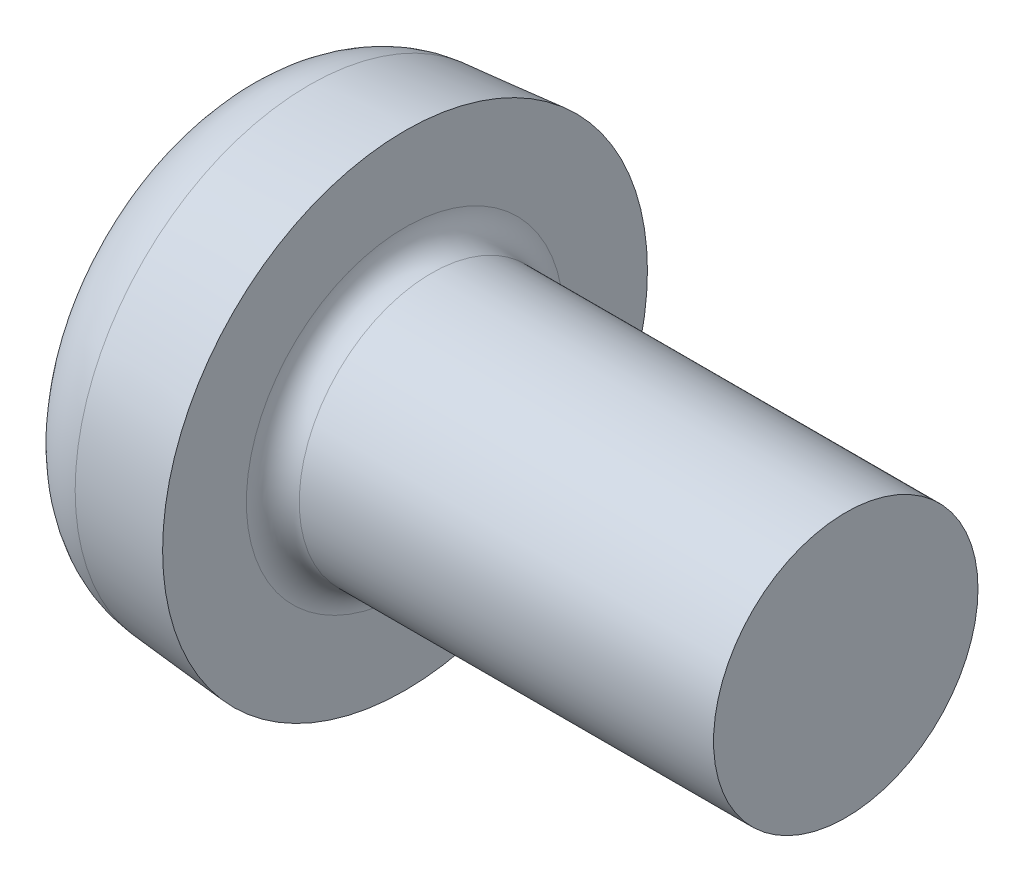
ISO-10303-21;
HEADER;
FILE_DESCRIPTION(('STEP AP214'),'2;1');
FILE_NAME('part.step','',(''),(''),'','','');
FILE_SCHEMA(('AUTOMOTIVE_DESIGN { 1 0 10303 214 1 1 1 1 }'));
ENDSEC;
DATA;
#1=APPLICATION_CONTEXT('core data for automotive mechanical design processes');
#2=APPLICATION_PROTOCOL_DEFINITION('international standard','automotive_design',2000,#1);
#3=PRODUCT_CONTEXT('',#1,'mechanical');
#4=PRODUCT('Part','Part','',(#3));
#5=PRODUCT_RELATED_PRODUCT_CATEGORY('part','',(#4));
#6=PRODUCT_DEFINITION_FORMATION('','',#4);
#7=PRODUCT_DEFINITION_CONTEXT('part definition',#1,'design');
#8=PRODUCT_DEFINITION('design','',#6,#7);
#9=PRODUCT_DEFINITION_SHAPE('','',#8);
#10=(LENGTH_UNIT() NAMED_UNIT(*) SI_UNIT(.MILLI.,.METRE.));
#11=(NAMED_UNIT(*) PLANE_ANGLE_UNIT() SI_UNIT($,.RADIAN.));
#12=(NAMED_UNIT(*) SI_UNIT($,.STERADIAN.) SOLID_ANGLE_UNIT());
#13=UNCERTAINTY_MEASURE_WITH_UNIT(LENGTH_MEASURE(1.E-05),#10,'distance_accuracy_value','');
#14=(GEOMETRIC_REPRESENTATION_CONTEXT(3) GLOBAL_UNCERTAINTY_ASSIGNED_CONTEXT((#13)) GLOBAL_UNIT_ASSIGNED_CONTEXT((#10,
#11,#12)) REPRESENTATION_CONTEXT('',''));
#15=CARTESIAN_POINT('',(0.,0.,0.));
#16=DIRECTION('',(0.,0.,1.));
#17=DIRECTION('',(1.,0.,0.));
#18=AXIS2_PLACEMENT_3D('',#15,#16,#17);
#19=CARTESIAN_POINT('',(0.,0.,0.));
#20=DIRECTION('',(-1.,0.,0.));
#21=DIRECTION('',(0.,0.,1.));
#22=AXIS2_PLACEMENT_3D('',#19,#20,#21);
#23=PLANE('',#22);
#24=DIRECTION('',(0.,1.,0.));
#25=VECTOR('',#24,1.);
#26=CARTESIAN_POINT('',(0.,0.349999999999987,-0.349999999999996));
#27=LINE('',#26,#25);
#28=CARTESIAN_POINT('',(1.66533453693773E-13,0.649999999999984,-0.349999999999996));
#29=VERTEX_POINT('',#28);
#30=CARTESIAN_POINT('',(-1.66533453693773E-13,1.62134434609832,-0.349999999999996));
#31=VERTEX_POINT('',#30);
#32=EDGE_CURVE('E332',#29,#31,#27,.T.);
#33=ORIENTED_EDGE('',*,*,#32,.T.);
#34=CARTESIAN_POINT('',(0.,0.,0.));
#35=DIRECTION('',(-1.,0.,0.));
#36=DIRECTION('',(0.,0.,1.));
#37=AXIS2_PLACEMENT_3D('',#34,#35,#36);
#38=CIRCLE('',#37,1.65869149893072);
#39=CARTESIAN_POINT('',(0.,0.349999999999977,-1.62134434609831));
#40=VERTEX_POINT('',#39);
#41=EDGE_CURVE('E297',#31,#40,#38,.T.);
#42=ORIENTED_EDGE('',*,*,#41,.T.);
#43=DIRECTION('',(0.,0.,1.));
#44=VECTOR('',#43,1.);
#45=CARTESIAN_POINT('',(0.,0.349999999999987,-0.349999999999996));
#46=LINE('',#45,#44);
#47=CARTESIAN_POINT('',(0.,0.349999999999996,-0.650000000000005));
#48=VERTEX_POINT('',#47);
#49=EDGE_CURVE('E310',#40,#48,#46,.T.);
#50=ORIENTED_EDGE('',*,*,#49,.T.);
#51=CARTESIAN_POINT('',(0.,0.649999999999991,-0.649999999999991));
#52=DIRECTION('',(-1.,0.,0.));
#53=DIRECTION('',(0.,0.,1.));
#54=AXIS2_PLACEMENT_3D('',#51,#52,#53);
#55=CIRCLE('',#54,0.3);
#56=EDGE_CURVE('E359',#48,#29,#55,.T.);
#57=ORIENTED_EDGE('',*,*,#56,.T.);
#58=EDGE_LOOP('',(#33,#42,#50,#57));
#59=FACE_BOUND('',#58,.T.);
#60=ADVANCED_FACE('F39',(#59),#23,.T.);
#61=DIRECTION('',(0.,0.,-1.));
#62=VECTOR('',#61,1.);
#63=CARTESIAN_POINT('',(0.,-0.350000000000005,-0.349999999999996));
#64=LINE('',#63,#62);
#65=CARTESIAN_POINT('',(-1.66533453693773E-13,-0.349999999999994,-0.650000000000019));
#66=VERTEX_POINT('',#65);
#67=CARTESIAN_POINT('',(-1.66533453693773E-13,-0.350000000000008,-1.62134434609833));
#68=VERTEX_POINT('',#67);
#69=EDGE_CURVE('E325',#66,#68,#64,.T.);
#70=ORIENTED_EDGE('',*,*,#69,.T.);
#71=CARTESIAN_POINT('',(0.,0.,0.));
#72=DIRECTION('',(-1.,0.,0.));
#73=DIRECTION('',(0.,0.,1.));
#74=AXIS2_PLACEMENT_3D('',#71,#72,#73);
#75=CIRCLE('',#74,1.65869149893072);
#76=CARTESIAN_POINT('',(0.,-1.62134434609834,-0.349999999999996));
#77=VERTEX_POINT('',#76);
#78=EDGE_CURVE('E289',#68,#77,#75,.T.);
#79=ORIENTED_EDGE('',*,*,#78,.T.);
#80=DIRECTION('',(0.,1.,0.));
#81=VECTOR('',#80,1.);
#82=CARTESIAN_POINT('',(0.,-0.350000000000005,-0.349999999999996));
#83=LINE('',#82,#81);
#84=CARTESIAN_POINT('',(-1.66533453693773E-13,-0.650000000000046,-0.349999999999996));
#85=VERTEX_POINT('',#84);
#86=EDGE_CURVE('E113',#77,#85,#83,.T.);
#87=ORIENTED_EDGE('',*,*,#86,.T.);
#88=CARTESIAN_POINT('',(2.4980018054066E-13,-0.650000000000005,-0.649999999999991));
#89=DIRECTION('',(-1.,0.,0.));
#90=DIRECTION('',(0.,0.,1.));
#91=AXIS2_PLACEMENT_3D('',#88,#89,#90);
#92=CIRCLE('',#91,0.3);
#93=EDGE_CURVE('E330',#85,#66,#92,.T.);
#94=ORIENTED_EDGE('',*,*,#93,.T.);
#95=EDGE_LOOP('',(#70,#79,#87,#94));
#96=FACE_BOUND('',#95,.T.);
#97=ADVANCED_FACE('F240',(#96),#23,.T.);
#98=DIRECTION('',(0.,-1.,0.));
#99=VECTOR('',#98,1.);
#100=CARTESIAN_POINT('',(-1.38777878078145E-13,-0.349999999999994,0.350000000000024));
#101=LINE('',#100,#99);
#102=CARTESIAN_POINT('',(0.,-0.650000000000012,0.350000000000017));
#103=VERTEX_POINT('',#102);
#104=CARTESIAN_POINT('',(0.,-1.62134434609837,0.350000000000017));
#105=VERTEX_POINT('',#104);
#106=EDGE_CURVE('E334',#103,#105,#101,.T.);
#107=ORIENTED_EDGE('',*,*,#106,.T.);
#108=CARTESIAN_POINT('',(0.,0.,0.));
#109=DIRECTION('',(-1.,0.,0.));
#110=DIRECTION('',(0.,0.,1.));
#111=AXIS2_PLACEMENT_3D('',#108,#109,#110);
#112=CIRCLE('',#111,1.65869149893072);
#113=CARTESIAN_POINT('',(0.,-0.350000000000033,1.62134434609835));
#114=VERTEX_POINT('',#113);
#115=EDGE_CURVE('E285',#105,#114,#112,.T.);
#116=ORIENTED_EDGE('',*,*,#115,.T.);
#117=DIRECTION('',(0.,0.,-1.));
#118=VECTOR('',#117,1.);
#119=CARTESIAN_POINT('',(-1.38777878078145E-13,-0.349999999999994,0.350000000000024));
#120=LINE('',#119,#118);
#121=CARTESIAN_POINT('',(0.,-0.349999999999996,0.650000000000005));
#122=VERTEX_POINT('',#121);
#123=EDGE_CURVE('E280',#114,#122,#120,.T.);
#124=ORIENTED_EDGE('',*,*,#123,.T.);
#125=CARTESIAN_POINT('',(-1.66533453693773E-13,-0.650000000000027,0.649999999999998));
#126=DIRECTION('',(-1.,0.,0.));
#127=DIRECTION('',(0.,0.,1.));
#128=AXIS2_PLACEMENT_3D('',#125,#126,#127);
#129=CIRCLE('',#128,0.3);
#130=EDGE_CURVE('E364',#122,#103,#129,.T.);
#131=ORIENTED_EDGE('',*,*,#130,.T.);
#132=EDGE_LOOP('',(#107,#116,#124,#131));
#133=FACE_BOUND('',#132,.T.);
#134=ADVANCED_FACE('F247',(#133),#23,.T.);
#135=DIRECTION('',(0.,0.,1.));
#136=VECTOR('',#135,1.);
#137=CARTESIAN_POINT('',(1.38777878078145E-13,0.349999999999984,0.349999999999989));
#138=LINE('',#137,#136);
#139=CARTESIAN_POINT('',(0.,0.349999999999974,0.649999999999977));
#140=VERTEX_POINT('',#139);
#141=CARTESIAN_POINT('',(1.66533453693773E-13,0.350000000000003,1.62134434609836));
#142=VERTEX_POINT('',#141);
#143=EDGE_CURVE('E266',#140,#142,#138,.T.);
#144=ORIENTED_EDGE('',*,*,#143,.T.);
#145=CARTESIAN_POINT('',(0.,0.,0.));
#146=DIRECTION('',(-1.,0.,0.));
#147=DIRECTION('',(0.,0.,1.));
#148=AXIS2_PLACEMENT_3D('',#145,#146,#147);
#149=CIRCLE('',#148,1.65869149893072);
#150=CARTESIAN_POINT('',(0.,1.6213443460983,0.349999999999996));
#151=VERTEX_POINT('',#150);
#152=EDGE_CURVE('E270',#142,#151,#149,.T.);
#153=ORIENTED_EDGE('',*,*,#152,.T.);
#154=DIRECTION('',(0.,-1.,0.));
#155=VECTOR('',#154,1.);
#156=CARTESIAN_POINT('',(1.38777878078145E-13,0.349999999999984,0.349999999999989));
#157=LINE('',#156,#155);
#158=CARTESIAN_POINT('',(1.66533453693773E-13,0.649999999999968,0.350000000000003));
#159=VERTEX_POINT('',#158);
#160=EDGE_CURVE('E339',#151,#159,#157,.T.);
#161=ORIENTED_EDGE('',*,*,#160,.T.);
#162=CARTESIAN_POINT('',(0.,0.649999999999989,0.650000000000019));
#163=DIRECTION('',(-1.,0.,0.));
#164=DIRECTION('',(0.,0.,1.));
#165=AXIS2_PLACEMENT_3D('',#162,#163,#164);
#166=CIRCLE('',#165,0.3);
#167=EDGE_CURVE('E274',#159,#140,#166,.T.);
#168=ORIENTED_EDGE('',*,*,#167,.T.);
#169=EDGE_LOOP('',(#144,#153,#161,#168));
#170=FACE_BOUND('',#169,.T.);
#171=ADVANCED_FACE('F243',(#170),#23,.T.);
#172=CARTESIAN_POINT('',(7.00000000000008,1.49999999999999,0.));
#173=DIRECTION('',(1.,0.,0.));
#174=DIRECTION('',(0.,0.,-1.));
#175=AXIS2_PLACEMENT_3D('',#172,#173,#174);
#176=PLANE('',#175);
#177=CARTESIAN_POINT('',(6.99999999999995,0.,0.));
#178=DIRECTION('',(1.,0.,0.));
#179=DIRECTION('',(0.,0.,-1.));
#180=AXIS2_PLACEMENT_3D('',#177,#178,#179);
#181=CIRCLE('',#180,1.5);
#182=CARTESIAN_POINT('',(6.99999999999995,0.,-1.49999999999999));
#183=VERTEX_POINT('',#182);
#184=EDGE_CURVE('E353',#183,#183,#181,.T.);
#185=ORIENTED_EDGE('',*,*,#184,.T.);
#186=EDGE_LOOP('',(#185));
#187=FACE_BOUND('',#186,.T.);
#188=ADVANCED_FACE('F252',(#187),#176,.T.);
#189=CARTESIAN_POINT('',(4.51581291088116,0.,0.));
#190=DIRECTION('',(1.,0.,0.));
#191=DIRECTION('',(0.,0.,-1.));
#192=AXIS2_PLACEMENT_3D('',#189,#190,#191);
#193=CYLINDRICAL_SURFACE('',#192,1.5);
#194=CARTESIAN_POINT('',(2.29999999999986,0.,0.));
#195=DIRECTION('',(1.,0.,0.));
#196=DIRECTION('',(0.,0.,-1.));
#197=AXIS2_PLACEMENT_3D('',#194,#195,#196);
#198=CIRCLE('',#197,1.5);
#199=CARTESIAN_POINT('',(2.29999999999986,0.,-1.49999999999998));
#200=VERTEX_POINT('',#199);
#201=EDGE_CURVE('E350',#200,#200,#198,.T.);
#202=ORIENTED_EDGE('',*,*,#201,.T.);
#203=EDGE_LOOP('',(#202));
#204=FACE_BOUND('',#203,.T.);
#205=ORIENTED_EDGE('',*,*,#184,.F.);
#206=EDGE_LOOP('',(#205));
#207=FACE_BOUND('',#206,.T.);
#208=ADVANCED_FACE('F258',(#204,#207),#193,.T.);
#209=CARTESIAN_POINT('',(2.29999999999986,0.,0.));
#210=DIRECTION('',(1.,0.,0.));
#211=DIRECTION('',(0.,0.,-1.));
#212=AXIS2_PLACEMENT_3D('',#209,#210,#211);
#213=TOROIDAL_SURFACE('',#212,1.8,0.3);
#214=CARTESIAN_POINT('',(2.,0.,0.));
#215=DIRECTION('',(1.,0.,0.));
#216=DIRECTION('',(0.,0.,-1.));
#217=AXIS2_PLACEMENT_3D('',#214,#215,#216);
#218=CIRCLE('',#217,1.8);
#219=CARTESIAN_POINT('',(2.,0.,-1.79999999999998));
#220=VERTEX_POINT('',#219);
#221=EDGE_CURVE('E346',#220,#220,#218,.T.);
#222=ORIENTED_EDGE('',*,*,#221,.T.);
#223=EDGE_LOOP('',(#222));
#224=FACE_BOUND('',#223,.T.);
#225=ORIENTED_EDGE('',*,*,#201,.F.);
#226=EDGE_LOOP('',(#225));
#227=FACE_BOUND('',#226,.T.);
#228=ADVANCED_FACE('F518',(#224,#227),#213,.F.);
#229=CARTESIAN_POINT('',(1.99999999999989,1.79999999999996,0.));
#230=DIRECTION('',(1.,0.,0.));
#231=DIRECTION('',(0.,0.,-1.));
#232=AXIS2_PLACEMENT_3D('',#229,#230,#231);
#233=PLANE('',#232);
#234=CARTESIAN_POINT('',(2.,0.,0.));
#235=DIRECTION('',(1.,0.,0.));
#236=DIRECTION('',(0.,0.,-1.));
#237=AXIS2_PLACEMENT_3D('',#234,#235,#236);
#238=CIRCLE('',#237,2.75);
#239=CARTESIAN_POINT('',(2.,0.,-2.74999999999998));
#240=VERTEX_POINT('',#239);
#241=EDGE_CURVE('E342',#240,#240,#238,.T.);
#242=ORIENTED_EDGE('',*,*,#241,.T.);
#243=EDGE_LOOP('',(#242));
#244=FACE_BOUND('',#243,.T.);
#245=ORIENTED_EDGE('',*,*,#221,.F.);
#246=EDGE_LOOP('',(#245));
#247=FACE_BOUND('',#246,.T.);
#248=ADVANCED_FACE('F522',(#244,#247),#233,.T.);
#249=CARTESIAN_POINT('',(2.,0.,0.));
#250=DIRECTION('',(1.,0.,0.));
#251=DIRECTION('',(0.,0.,-1.));
#252=AXIS2_PLACEMENT_3D('',#249,#250,#251);
#253=CONICAL_SURFACE('',#252,2.75,0.0872664625997202);
#254=CARTESIAN_POINT('',(0.912844257252354,0.,0.));
#255=DIRECTION('',(-1.,0.,0.));
#256=DIRECTION('',(0.,0.,1.));
#257=AXIS2_PLACEMENT_3D('',#254,#255,#256);
#258=CIRCLE('',#257,2.65488619702247);
#259=CARTESIAN_POINT('',(0.912844257252354,0.,2.65488619702247));
#260=VERTEX_POINT('',#259);
#261=EDGE_CURVE('E286',#260,#260,#258,.F.);
#262=ORIENTED_EDGE('',*,*,#261,.T.);
#263=EDGE_LOOP('',(#262));
#264=FACE_BOUND('',#263,.T.);
#265=ORIENTED_EDGE('',*,*,#241,.F.);
#266=EDGE_LOOP('',(#265));
#267=FACE_BOUND('',#266,.T.);
#268=ADVANCED_FACE('F525',(#264,#267),#253,.T.);
#269=CARTESIAN_POINT('',(1.99999999999992,0.349999999999975,0.350000000000003));
#270=DIRECTION('',(0.,-1.,0.));
#271=DIRECTION('',(0.,0.,-1.));
#272=AXIS2_PLACEMENT_3D('',#269,#270,#271);
#273=PLANE('',#272);
#274=DIRECTION('',(-0.939692620785911,0.,0.342020143325669));
#275=VECTOR('',#274,1.);
#276=CARTESIAN_POINT('',(0.,0.350000000000003,1.75));
#277=LINE('',#276,#275);
#278=CARTESIAN_POINT('',(1.99999999999997,0.350000000000005,1.02205953146763));
#279=VERTEX_POINT('',#278);
#280=CARTESIAN_POINT('',(0.0076236649165784,0.349999999999982,1.74722521289429));
#281=VERTEX_POINT('',#280);
#282=EDGE_CURVE('E347',#279,#281,#277,.T.);
#283=ORIENTED_EDGE('',*,*,#282,.T.);
#284=CARTESIAN_POINT('',(0.0079653557313597,0.349999999999975,1.75));
#285=CARTESIAN_POINT('',(0.00530925160596878,0.34999999999997,1.72863961284291));
#286=CARTESIAN_POINT('',(0.00331741989972144,0.34999999999997,1.70723809914298));
#287=CARTESIAN_POINT('',(0.000662305181364531,0.349999999999979,1.66435288093687));
#288=CARTESIAN_POINT('',(-9.81689452523793E-07,0.349999999999989,1.64286917666958));
#289=CARTESIAN_POINT('',(1.66533453693773E-13,0.350000000000003,1.62134434609836));
#290=B_SPLINE_CURVE_WITH_KNOTS('',3,(#284,#285,#286,#287,#288,#289),.UNSPECIFIED.,.F.,.F.,(4,2,
4),(0.,0.064482010202445,0.128963833119095),.UNSPECIFIED.);
#291=EDGE_CURVE('E182',#281,#142,#290,.T.);
#292=ORIENTED_EDGE('',*,*,#291,.T.);
#293=ORIENTED_EDGE('',*,*,#143,.F.);
#294=DIRECTION('',(-1.,0.,0.));
#295=VECTOR('',#294,1.);
#296=CARTESIAN_POINT('',(2.0000000000002,0.350000000000008,0.649999999999991));
#297=LINE('',#296,#295);
#298=CARTESIAN_POINT('',(2.0000000000002,0.350000000000008,0.649999999999991));
#299=VERTEX_POINT('',#298);
#300=EDGE_CURVE('E377',#140,#299,#297,.F.);
#301=ORIENTED_EDGE('',*,*,#300,.T.);
#302=DIRECTION('',(0.,0.,1.));
#303=VECTOR('',#302,1.);
#304=CARTESIAN_POINT('',(1.99999999999992,0.349999999999975,0.350000000000003));
#305=LINE('',#304,#303);
#306=EDGE_CURVE('E341',#299,#279,#305,.T.);
#307=ORIENTED_EDGE('',*,*,#306,.T.);
#308=EDGE_LOOP('',(#283,#292,#293,#301,#307));
#309=FACE_BOUND('',#308,.T.);
#310=ADVANCED_FACE('F432',(#309),#273,.T.);
#311=CARTESIAN_POINT('',(1.38777878078145E-13,0.,1.74999999999999));
#312=DIRECTION('',(-0.342020143325671,0.,-0.939692620785908));
#313=DIRECTION('',(-0.939692620785911,0.,0.342020143325669));
#314=AXIS2_PLACEMENT_3D('',#311,#312,#313);
#315=PLANE('',#314);
#316=DIRECTION('',(-0.939692620785911,0.,0.342020143325669));
#317=VECTOR('',#316,1.);
#318=CARTESIAN_POINT('',(2.21599576989942,-0.349999999999996,0.94344350049673));
#319=LINE('',#318,#317);
#320=CARTESIAN_POINT('',(2.00000000000024,-0.350000000000012,1.02205953146761));
#321=VERTEX_POINT('',#320);
#322=CARTESIAN_POINT('',(0.00762366491673105,-0.350000000000038,1.74722521289429));
#323=VERTEX_POINT('',#322);
#324=EDGE_CURVE('E428',#321,#323,#319,.T.);
#325=ORIENTED_EDGE('',*,*,#324,.T.);
#326=CARTESIAN_POINT('',(0.00762366491673105,-0.350000000000038,1.74722521289429));
#327=CARTESIAN_POINT('',(0.00630099140157087,-0.291673398723685,1.74770662668349));
#328=CARTESIAN_POINT('',(0.00540592205483561,-0.233339136124094,1.74803240528331));
#329=CARTESIAN_POINT('',(0.00427721541087059,-0.116669915073291,1.74844322090494));
#330=CARTESIAN_POINT('',(0.00404349915769444,-0.0583349575366595,1.74852828666436));
#331=CARTESIAN_POINT('',(0.0040434991577028,0.0583349575366036,1.74852828666436));
#332=CARTESIAN_POINT('',(0.00427721541088731,0.116669915073235,1.74844322090494));
#333=CARTESIAN_POINT('',(0.00540592205481835,0.233339136124037,1.74803240528331));
#334=CARTESIAN_POINT('',(0.00630099140151127,0.291673398723628,1.74770662668349));
#335=CARTESIAN_POINT('',(0.0076236649165784,0.349999999999982,1.74722521289429));
#336=B_SPLINE_CURVE_WITH_KNOTS('',3,(#326,#327,#328,#329,#330,#331,#332,#333,#334,#335),
.UNSPECIFIED.,.F.,.F.,(4,2,2,2,4),(0.,0.175023999924847,0.350027103646384,0.52503020736792,
0.700054207292766),.UNSPECIFIED.);
#337=EDGE_CURVE('E136',#323,#281,#336,.T.);
#338=ORIENTED_EDGE('',*,*,#337,.T.);
#339=ORIENTED_EDGE('',*,*,#282,.F.);
#340=DIRECTION('',(0.,-1.,0.));
#341=VECTOR('',#340,1.);
#342=CARTESIAN_POINT('',(2.,0.,1.02205953146758));
#343=LINE('',#342,#341);
#344=EDGE_CURVE('E435',#279,#321,#343,.T.);
#345=ORIENTED_EDGE('',*,*,#344,.T.);
#346=EDGE_LOOP('',(#325,#338,#339,#345));
#347=FACE_BOUND('',#346,.T.);
#348=ADVANCED_FACE('F160',(#347),#315,.T.);
#349=CARTESIAN_POINT('',(2.00000000000003,-0.349999999999994,0.350000000000017));
#350=DIRECTION('',(0.,1.,0.));
#351=DIRECTION('',(0.,0.,1.));
#352=AXIS2_PLACEMENT_3D('',#349,#350,#351);
#353=PLANE('',#352);
#354=ORIENTED_EDGE('',*,*,#123,.F.);
#355=CARTESIAN_POINT('',(0.,-0.350000000000033,1.62134434609835));
#356=CARTESIAN_POINT('',(-9.81689475979986E-07,-0.350000000000008,1.64286917666957));
#357=CARTESIAN_POINT('',(0.000662305181368675,-0.349999999999995,1.66435288093686));
#358=CARTESIAN_POINT('',(0.00331741989971635,-0.349999999999995,1.70723809914298));
#359=CARTESIAN_POINT('',(0.00530925160592683,-0.350000000000007,1.72863961284291));
#360=CARTESIAN_POINT('',(0.00796535573124868,-0.350000000000031,1.75000000000002));
#361=B_SPLINE_CURVE_WITH_KNOTS('',3,(#355,#356,#357,#358,#359,#360),.UNSPECIFIED.,.F.,.F.,(4,2,
4),(0.,0.0644818229166605,0.128963833119115),.UNSPECIFIED.);
#362=EDGE_CURVE('E130',#114,#323,#361,.T.);
#363=ORIENTED_EDGE('',*,*,#362,.T.);
#364=ORIENTED_EDGE('',*,*,#324,.F.);
#365=DIRECTION('',(0.,0.,-1.));
#366=VECTOR('',#365,1.);
#367=CARTESIAN_POINT('',(2.00000000000003,-0.349999999999994,0.350000000000017));
#368=LINE('',#367,#366);
#369=CARTESIAN_POINT('',(2.00000000000009,-0.349999999999996,0.649999999999977));
#370=VERTEX_POINT('',#369);
#371=EDGE_CURVE('E436',#321,#370,#368,.T.);
#372=ORIENTED_EDGE('',*,*,#371,.T.);
#373=DIRECTION('',(-1.,0.,0.));
#374=VECTOR('',#373,1.);
#375=CARTESIAN_POINT('',(2.00000000000009,-0.349999999999996,0.649999999999977));
#376=LINE('',#375,#374);
#377=EDGE_CURVE('E356',#370,#122,#376,.T.);
#378=ORIENTED_EDGE('',*,*,#377,.T.);
#379=EDGE_LOOP('',(#354,#363,#364,#372,#378));
#380=FACE_BOUND('',#379,.T.);
#381=ADVANCED_FACE('F462',(#380),#353,.T.);
#382=CARTESIAN_POINT('',(2.00000000000003,-0.349999999999994,0.350000000000017));
#383=DIRECTION('',(0.,0.,-1.));
#384=DIRECTION('',(0.,1.,0.));
#385=AXIS2_PLACEMENT_3D('',#382,#383,#384);
#386=PLANE('',#385);
#387=DIRECTION('',(-0.939692620785912,-0.34202014332567,0.));
#388=VECTOR('',#387,1.);
#389=CARTESIAN_POINT('',(0.,-1.75000000000004,0.350000000000003));
#390=LINE('',#389,#388);
#391=CARTESIAN_POINT('',(1.99999999999992,-1.02205953146762,0.350000000000031));
#392=VERTEX_POINT('',#391);
#393=CARTESIAN_POINT('',(0.00762366491674493,-1.74722521289432,0.35000000000001));
#394=VERTEX_POINT('',#393);
#395=EDGE_CURVE('E120',#392,#394,#390,.T.);
#396=ORIENTED_EDGE('',*,*,#395,.T.);
#397=CARTESIAN_POINT('',(0.0079653557311099,-1.75000000000002,0.349999999999996));
#398=CARTESIAN_POINT('',(0.00530925160586914,-1.72863961284292,0.350000000000006));
#399=CARTESIAN_POINT('',(0.00331741989970498,-1.70723809914298,0.350000000000013));
#400=CARTESIAN_POINT('',(0.000662305181380392,-1.66435288093686,0.35000000000002));
#401=CARTESIAN_POINT('',(-9.81689487457113E-07,-1.64286917666958,0.35000000000002));
#402=CARTESIAN_POINT('',(0.,-1.62134434609837,0.350000000000017));
#403=B_SPLINE_CURVE_WITH_KNOTS('',3,(#397,#398,#399,#400,#401,#402),.UNSPECIFIED.,.F.,.F.,(4,2,
4),(0.,0.0644820102024414,0.128963833119091),.UNSPECIFIED.);
#404=EDGE_CURVE('E129',#394,#105,#403,.T.);
#405=ORIENTED_EDGE('',*,*,#404,.T.);
#406=ORIENTED_EDGE('',*,*,#106,.F.);
#407=DIRECTION('',(-1.,0.,0.));
#408=VECTOR('',#407,1.);
#409=CARTESIAN_POINT('',(2.00000000000017,-0.650000000000026,0.350000000000017));
#410=LINE('',#409,#408);
#411=CARTESIAN_POINT('',(2.00000000000017,-0.650000000000026,0.350000000000017));
#412=VERTEX_POINT('',#411);
#413=EDGE_CURVE('E367',#103,#412,#410,.F.);
#414=ORIENTED_EDGE('',*,*,#413,.T.);
#415=DIRECTION('',(0.,-1.,0.));
#416=VECTOR('',#415,1.);
#417=CARTESIAN_POINT('',(2.00000000000003,-0.349999999999994,0.350000000000017));
#418=LINE('',#417,#416);
#419=EDGE_CURVE('E438',#412,#392,#418,.T.);
#420=ORIENTED_EDGE('',*,*,#419,.T.);
#421=EDGE_LOOP('',(#396,#405,#406,#414,#420));
#422=FACE_BOUND('',#421,.T.);
#423=ADVANCED_FACE('F152',(#422),#386,.T.);
#424=CARTESIAN_POINT('',(1.94289029309402E-13,-1.75000000000002,0.));
#425=DIRECTION('',(-0.342020143325671,0.939692620785909,0.));
#426=DIRECTION('',(-0.939692620785912,-0.34202014332567,0.));
#427=AXIS2_PLACEMENT_3D('',#424,#425,#426);
#428=PLANE('',#427);
#429=DIRECTION('',(-0.939692620785912,-0.34202014332567,0.));
#430=VECTOR('',#429,1.);
#431=CARTESIAN_POINT('',(2.21599576989939,-0.943443500496771,-0.349999999999982));
#432=LINE('',#431,#430);
#433=CARTESIAN_POINT('',(2.00000000000015,-1.02205953146761,-0.349999999999989));
#434=VERTEX_POINT('',#433);
#435=CARTESIAN_POINT('',(0.00762366491674493,-1.74722521289431,-0.350000000000003));
#436=VERTEX_POINT('',#435);
#437=EDGE_CURVE('E108',#434,#436,#432,.T.);
#438=ORIENTED_EDGE('',*,*,#437,.T.);
#439=CARTESIAN_POINT('',(0.00762366491674493,-1.74722521289431,-0.350000000000003));
#440=CARTESIAN_POINT('',(0.00630099140157419,-1.74770662668353,-0.291673398723651));
#441=CARTESIAN_POINT('',(0.00540592205483865,-1.74803240528336,-0.23333913612406));
#442=CARTESIAN_POINT('',(0.00427721541087623,-1.748443220905,-0.116669915073259));
#443=CARTESIAN_POINT('',(0.00404349915770297,-1.74852828666441,-0.0583349575366277));
#444=CARTESIAN_POINT('',(0.00404349915770294,-1.74852828666441,0.0583349575366346));
#445=CARTESIAN_POINT('',(0.00427721541087617,-1.748443220905,0.116669915073266));
#446=CARTESIAN_POINT('',(0.00540592205483856,-1.74803240528336,0.233339136124067));
#447=CARTESIAN_POINT('',(0.00630099140157413,-1.74770662668353,0.291673398723658));
#448=CARTESIAN_POINT('',(0.00762366491674493,-1.7472252128943,0.35000000000001));
#449=B_SPLINE_CURVE_WITH_KNOTS('',3,(#439,#440,#441,#442,#443,#444,#445,#446,#447,#448),
.UNSPECIFIED.,.F.,.F.,(4,2,2,2,4),(0.,0.175023999924846,0.350027103646381,0.525030207367916,
0.700054207292762),.UNSPECIFIED.);
#450=EDGE_CURVE('E44',#436,#394,#449,.T.);
#451=ORIENTED_EDGE('',*,*,#450,.T.);
#452=ORIENTED_EDGE('',*,*,#395,.F.);
#453=DIRECTION('',(0.,0.,-1.));
#454=VECTOR('',#453,1.);
#455=CARTESIAN_POINT('',(1.99999999999999,-1.0220595314676,0.));
#456=LINE('',#455,#454);
#457=EDGE_CURVE('E119',#392,#434,#456,.T.);
#458=ORIENTED_EDGE('',*,*,#457,.T.);
#459=EDGE_LOOP('',(#438,#451,#452,#458));
#460=FACE_BOUND('',#459,.T.);
#461=ADVANCED_FACE('F41',(#460),#428,.T.);
#462=CARTESIAN_POINT('',(2.00000000000009,-0.350000000000045,-0.349999999999989));
#463=DIRECTION('',(0.,0.,1.));
#464=DIRECTION('',(0.,-1.,0.));
#465=AXIS2_PLACEMENT_3D('',#462,#463,#464);
#466=PLANE('',#465);
#467=ORIENTED_EDGE('',*,*,#86,.F.);
#468=CARTESIAN_POINT('',(0.,-1.62134434609834,-0.349999999999996));
#469=CARTESIAN_POINT('',(-9.81689494540674E-07,-1.64286917666956,-0.349999999999992));
#470=CARTESIAN_POINT('',(0.000662305181377858,-1.66435288093686,-0.349999999999989));
#471=CARTESIAN_POINT('',(0.00331741989970707,-1.70723809914299,-0.349999999999989));
#472=CARTESIAN_POINT('',(0.0053092516058713,-1.72863961284294,-0.349999999999992));
#473=CARTESIAN_POINT('',(0.0079653557311099,-1.75000000000005,-0.349999999999996));
#474=B_SPLINE_CURVE_WITH_KNOTS('',3,(#468,#469,#470,#471,#472,#473),.UNSPECIFIED.,.F.,.F.,(4,2,
4),(0.,0.064481822916676,0.128963833119145),.UNSPECIFIED.);
#475=EDGE_CURVE('E105',#77,#436,#474,.T.);
#476=ORIENTED_EDGE('',*,*,#475,.T.);
#477=ORIENTED_EDGE('',*,*,#437,.F.);
#478=DIRECTION('',(0.,1.,0.));
#479=VECTOR('',#478,1.);
#480=CARTESIAN_POINT('',(2.00000000000009,-0.350000000000045,-0.349999999999989));
#481=LINE('',#480,#479);
#482=CARTESIAN_POINT('',(2.00000000000017,-0.650000000000038,-0.349999999999989));
#483=VERTEX_POINT('',#482);
#484=EDGE_CURVE('E443',#434,#483,#481,.T.);
#485=ORIENTED_EDGE('',*,*,#484,.T.);
#486=DIRECTION('',(-1.,0.,0.));
#487=VECTOR('',#486,1.);
#488=CARTESIAN_POINT('',(2.00000000000017,-0.650000000000038,-0.349999999999989));
#489=LINE('',#488,#487);
#490=EDGE_CURVE('E370',#483,#85,#489,.T.);
#491=ORIENTED_EDGE('',*,*,#490,.T.);
#492=EDGE_LOOP('',(#467,#476,#477,#485,#491));
#493=FACE_BOUND('',#492,.T.);
#494=ADVANCED_FACE('F106',(#493),#466,.T.);
#495=CARTESIAN_POINT('',(2.00000000000009,-0.350000000000045,-0.349999999999989));
#496=DIRECTION('',(0.,1.,0.));
#497=DIRECTION('',(0.,0.,1.));
#498=AXIS2_PLACEMENT_3D('',#495,#496,#497);
#499=PLANE('',#498);
#500=DIRECTION('',(-0.939692620785912,0.,-0.342020143325669));
#501=VECTOR('',#500,1.);
#502=CARTESIAN_POINT('',(0.,-0.35000000000001,-1.75000000000002));
#503=LINE('',#502,#501);
#504=CARTESIAN_POINT('',(2.00000000000025,-0.350000000000001,-1.02205953146757));
#505=VERTEX_POINT('',#504);
#506=CARTESIAN_POINT('',(0.00762366491673105,-0.350000000000031,-1.74722521289427));
#507=VERTEX_POINT('',#506);
#508=EDGE_CURVE('E121',#505,#507,#503,.T.);
#509=ORIENTED_EDGE('',*,*,#508,.T.);
#510=CARTESIAN_POINT('',(0.00796535573127644,-0.350000000000001,-1.75));
#511=CARTESIAN_POINT('',(0.0053092516059824,-0.350000000000028,-1.7286396128429));
#512=CARTESIAN_POINT('',(0.0033174198997627,-0.350000000000043,-1.70723809914296));
#513=CARTESIAN_POINT('',(0.000662305181322682,-0.350000000000047,-1.66435288093683));
#514=CARTESIAN_POINT('',(-9.81689605268754E-07,-0.350000000000037,-1.64286917666955));
#515=CARTESIAN_POINT('',(-1.66533453693773E-13,-0.350000000000015,-1.62134434609833));
#516=B_SPLINE_CURVE_WITH_KNOTS('',3,(#510,#511,#512,#513,#514,#515),.UNSPECIFIED.,.F.,.F.,(4,2,
4),(0.,0.0644820102024676,0.128963833119132),.UNSPECIFIED.);
#517=EDGE_CURVE('E116',#507,#68,#516,.T.);
#518=ORIENTED_EDGE('',*,*,#517,.T.);
#519=ORIENTED_EDGE('',*,*,#69,.F.);
#520=DIRECTION('',(-1.,0.,0.));
#521=VECTOR('',#520,1.);
#522=CARTESIAN_POINT('',(2.0000000000001,-0.35000000000001,-0.649999999999998));
#523=LINE('',#522,#521);
#524=CARTESIAN_POINT('',(2.0000000000001,-0.35000000000001,-0.649999999999998));
#525=VERTEX_POINT('',#524);
#526=EDGE_CURVE('E372',#66,#525,#523,.F.);
#527=ORIENTED_EDGE('',*,*,#526,.T.);
#528=DIRECTION('',(0.,0.,-1.));
#529=VECTOR('',#528,1.);
#530=CARTESIAN_POINT('',(2.00000000000009,-0.350000000000045,-0.349999999999989));
#531=LINE('',#530,#529);
#532=EDGE_CURVE('E445',#525,#505,#531,.T.);
#533=ORIENTED_EDGE('',*,*,#532,.T.);
#534=EDGE_LOOP('',(#509,#518,#519,#527,#533));
#535=FACE_BOUND('',#534,.T.);
#536=ADVANCED_FACE('F225',(#535),#499,.T.);
#537=CARTESIAN_POINT('',(0.,0.,-1.74999999999999));
#538=DIRECTION('',(-0.342020143325671,0.,0.939692620785909));
#539=DIRECTION('',(0.939692620785912,0.,0.342020143325669));
#540=AXIS2_PLACEMENT_3D('',#537,#538,#539);
#541=PLANE('',#540);
#542=DIRECTION('',(-0.939692620785912,0.,-0.342020143325669));
#543=VECTOR('',#542,1.);
#544=CARTESIAN_POINT('',(2.21599576989961,0.350000000000019,-0.94344350049675));
#545=LINE('',#544,#543);
#546=CARTESIAN_POINT('',(2.00000000000017,0.349999999999993,-1.02205953146757));
#547=VERTEX_POINT('',#546);
#548=CARTESIAN_POINT('',(0.00762366491671718,0.349999999999987,-1.74722521289428));
#549=VERTEX_POINT('',#548);
#550=EDGE_CURVE('E307',#547,#549,#545,.T.);
#551=ORIENTED_EDGE('',*,*,#550,.T.);
#552=CARTESIAN_POINT('',(0.00762366491671718,0.349999999999987,-1.74722521289428));
#553=CARTESIAN_POINT('',(0.00630099140156141,0.291673398723634,-1.74770662668348));
#554=CARTESIAN_POINT('',(0.00540592205483206,0.233339136124044,-1.7480324052833));
#555=CARTESIAN_POINT('',(0.00427721541087438,0.116669915073241,-1.74844322090493));
#556=CARTESIAN_POINT('',(0.00404349915769967,0.0583349575366098,-1.74852828666435));
#557=CARTESIAN_POINT('',(0.00404349915769902,-0.0583349575366533,-1.74852828666435));
#558=CARTESIAN_POINT('',(0.00427721541087309,-0.116669915073285,-1.74844322090493));
#559=CARTESIAN_POINT('',(0.00540592205483391,-0.233339136124087,-1.7480324052833));
#560=CARTESIAN_POINT('',(0.00630099140156706,-0.291673398723678,-1.74770662668348));
#561=CARTESIAN_POINT('',(0.00762366491673105,-0.350000000000031,-1.74722521289427));
#562=B_SPLINE_CURVE_WITH_KNOTS('',3,(#552,#553,#554,#555,#556,#557,#558,#559,#560,#561),
.UNSPECIFIED.,.F.,.F.,(4,2,2,2,4),(0.,0.175023999924846,0.350027103646383,0.52503020736792,
0.700054207292766),.UNSPECIFIED.);
#563=EDGE_CURVE('E214',#549,#507,#562,.T.);
#564=ORIENTED_EDGE('',*,*,#563,.T.);
#565=ORIENTED_EDGE('',*,*,#508,.F.);
#566=DIRECTION('',(0.,1.,0.));
#567=VECTOR('',#566,1.);
#568=CARTESIAN_POINT('',(1.99999999999999,0.,-1.0220595314676));
#569=LINE('',#568,#567);
#570=EDGE_CURVE('E315',#505,#547,#569,.T.);
#571=ORIENTED_EDGE('',*,*,#570,.T.);
#572=EDGE_LOOP('',(#551,#564,#565,#571));
#573=FACE_BOUND('',#572,.T.);
#574=ADVANCED_FACE('F221',(#573),#541,.T.);
#575=CARTESIAN_POINT('',(2.00000000000003,0.350000000000008,-0.349999999999996));
#576=DIRECTION('',(0.,-1.,0.));
#577=DIRECTION('',(0.,0.,-1.));
#578=AXIS2_PLACEMENT_3D('',#575,#576,#577);
#579=PLANE('',#578);
#580=ORIENTED_EDGE('',*,*,#49,.F.);
#581=CARTESIAN_POINT('',(0.,0.349999999999977,-1.62134434609831));
#582=CARTESIAN_POINT('',(-9.81689506835992E-07,0.349999999999992,-1.64286917666953));
#583=CARTESIAN_POINT('',(0.000662305181388351,0.350000000000002,-1.66435288093681));
#584=CARTESIAN_POINT('',(0.00331741989969448,0.350000000000014,-1.70723809914294));
#585=CARTESIAN_POINT('',(0.00530925160581279,0.350000000000016,-1.72863961284288));
#586=CARTESIAN_POINT('',(0.00796535573097112,0.350000000000014,-1.74999999999999));
#587=B_SPLINE_CURVE_WITH_KNOTS('',3,(#581,#582,#583,#584,#585,#586),.UNSPECIFIED.,.F.,.F.,(4,2,
4),(0.,0.0644818229166589,0.128963833119108),.UNSPECIFIED.);
#588=EDGE_CURVE('E166',#40,#549,#587,.T.);
#589=ORIENTED_EDGE('',*,*,#588,.T.);
#590=ORIENTED_EDGE('',*,*,#550,.F.);
#591=DIRECTION('',(0.,0.,1.));
#592=VECTOR('',#591,1.);
#593=CARTESIAN_POINT('',(2.00000000000003,0.350000000000008,-0.349999999999996));
#594=LINE('',#593,#592);
#595=CARTESIAN_POINT('',(2.00000000000009,0.349999999999989,-0.650000000000019));
#596=VERTEX_POINT('',#595);
#597=EDGE_CURVE('E398',#547,#596,#594,.T.);
#598=ORIENTED_EDGE('',*,*,#597,.T.);
#599=DIRECTION('',(-1.,0.,0.));
#600=VECTOR('',#599,1.);
#601=CARTESIAN_POINT('',(2.00000000000009,0.349999999999989,-0.650000000000019));
#602=LINE('',#601,#600);
#603=EDGE_CURVE('E379',#596,#48,#602,.T.);
#604=ORIENTED_EDGE('',*,*,#603,.T.);
#605=EDGE_LOOP('',(#580,#589,#590,#598,#604));
#606=FACE_BOUND('',#605,.T.);
#607=ADVANCED_FACE('F224',(#606),#579,.T.);
#608=CARTESIAN_POINT('',(2.00000000000003,0.350000000000008,-0.349999999999996));
#609=DIRECTION('',(0.,0.,1.));
#610=DIRECTION('',(0.,-1.,0.));
#611=AXIS2_PLACEMENT_3D('',#608,#609,#610);
#612=PLANE('',#611);
#613=DIRECTION('',(-0.939692620785912,0.34202014332567,0.));
#614=VECTOR('',#613,1.);
#615=CARTESIAN_POINT('',(0.,1.74999999999999,-0.35000000000001));
#616=LINE('',#615,#614);
#617=CARTESIAN_POINT('',(2.,1.02205953146758,-0.349999999999996));
#618=VERTEX_POINT('',#617);
#619=CARTESIAN_POINT('',(0.00762366491689759,1.74722521289431,-0.35000000000001));
#620=VERTEX_POINT('',#619);
#621=EDGE_CURVE('E316',#618,#620,#616,.T.);
#622=ORIENTED_EDGE('',*,*,#621,.T.);
#623=CARTESIAN_POINT('',(0.00796535573108215,1.74999999999999,-0.350000000000031));
#624=CARTESIAN_POINT('',(0.00530925160588468,1.72863961284288,-0.350000000000013));
#625=CARTESIAN_POINT('',(0.00331741989972945,1.70723809914294,-0.350000000000002));
#626=CARTESIAN_POINT('',(0.000662305181354066,1.66435288093681,-0.34999999999999));
#627=CARTESIAN_POINT('',(-9.81689573594902E-07,1.64286917666953,-0.34999999999999));
#628=CARTESIAN_POINT('',(-1.66533453693773E-13,1.62134434609832,-0.349999999999996));
#629=B_SPLINE_CURVE_WITH_KNOTS('',3,(#623,#624,#625,#626,#627,#628),.UNSPECIFIED.,.F.,.F.,(4,2,
4),(0.,0.0644820102024546,0.128963833119113),.UNSPECIFIED.);
#630=EDGE_CURVE('E11',#620,#31,#629,.T.);
#631=ORIENTED_EDGE('',*,*,#630,.T.);
#632=ORIENTED_EDGE('',*,*,#32,.F.);
#633=DIRECTION('',(-1.,0.,0.));
#634=VECTOR('',#633,1.);
#635=CARTESIAN_POINT('',(2.00000000000033,0.649999999999991,-0.349999999999982));
#636=LINE('',#635,#634);
#637=CARTESIAN_POINT('',(2.00000000000033,0.649999999999991,-0.349999999999982));
#638=VERTEX_POINT('',#637);
#639=EDGE_CURVE('E381',#29,#638,#636,.F.);
#640=ORIENTED_EDGE('',*,*,#639,.T.);
#641=DIRECTION('',(0.,1.,0.));
#642=VECTOR('',#641,1.);
#643=CARTESIAN_POINT('',(2.00000000000003,0.350000000000008,-0.349999999999996));
#644=LINE('',#643,#642);
#645=EDGE_CURVE('E402',#638,#618,#644,.T.);
#646=ORIENTED_EDGE('',*,*,#645,.T.);
#647=EDGE_LOOP('',(#622,#631,#632,#640,#646));
#648=FACE_BOUND('',#647,.T.);
#649=ADVANCED_FACE('F231',(#648),#612,.T.);
#650=CARTESIAN_POINT('',(-1.66533453693773E-13,1.74999999999999,0.));
#651=DIRECTION('',(-0.342020143325671,-0.939692620785909,0.));
#652=DIRECTION('',(0.939692620785912,-0.34202014332567,0.));
#653=AXIS2_PLACEMENT_3D('',#650,#651,#652);
#654=PLANE('',#653);
#655=DIRECTION('',(-0.939692620785912,0.34202014332567,0.));
#656=VECTOR('',#655,1.);
#657=CARTESIAN_POINT('',(2.21599576989956,0.943443500496731,0.350000000000024));
#658=LINE('',#657,#656);
#659=CARTESIAN_POINT('',(2.,1.0220595314676,0.350000000000031));
#660=VERTEX_POINT('',#659);
#661=CARTESIAN_POINT('',(0.00762366491691147,1.74722521289428,0.35000000000001));
#662=VERTEX_POINT('',#661);
#663=EDGE_CURVE('E451',#660,#662,#658,.T.);
#664=ORIENTED_EDGE('',*,*,#663,.T.);
#665=CARTESIAN_POINT('',(0.00762366491691147,1.74722521289428,0.35000000000001));
#666=CARTESIAN_POINT('',(0.00630099140162064,1.74770662668341,0.291673398723658));
#667=CARTESIAN_POINT('',(0.00540592205484019,1.74803240528321,0.233339136124067));
#668=CARTESIAN_POINT('',(0.00427721541084823,1.74844322090482,0.116669915073264));
#669=CARTESIAN_POINT('',(0.00404349915769032,1.74852828666425,0.0583349575366319));
#670=CARTESIAN_POINT('',(0.00404349915769117,1.74852828666424,-0.0583349575366319));
#671=CARTESIAN_POINT('',(0.00427721541084994,1.74844322090482,-0.116669915073264));
#672=CARTESIAN_POINT('',(0.00540592205483885,1.74803240528321,-0.233339136124067));
#673=CARTESIAN_POINT('',(0.00630099140161541,1.74770662668342,-0.291673398723658));
#674=CARTESIAN_POINT('',(0.00762366491689759,1.74722521289431,-0.35000000000001));
#675=B_SPLINE_CURVE_WITH_KNOTS('',3,(#665,#666,#667,#668,#669,#670,#671,#672,#673,#674),
.UNSPECIFIED.,.F.,.F.,(4,2,2,2,4),(0.,0.175023999924849,0.350027103646386,0.525030207367924,
0.700054207292773),.UNSPECIFIED.);
#676=EDGE_CURVE('E54',#662,#620,#675,.T.);
#677=ORIENTED_EDGE('',*,*,#676,.T.);
#678=ORIENTED_EDGE('',*,*,#621,.F.);
#679=DIRECTION('',(0.,0.,1.));
#680=VECTOR('',#679,1.);
#681=CARTESIAN_POINT('',(1.99999999999992,1.0220595314676,0.));
#682=LINE('',#681,#680);
#683=EDGE_CURVE('E448',#618,#660,#682,.T.);
#684=ORIENTED_EDGE('',*,*,#683,.T.);
#685=EDGE_LOOP('',(#664,#677,#678,#684));
#686=FACE_BOUND('',#685,.T.);
#687=ADVANCED_FACE('F227',(#686),#654,.T.);
#688=CARTESIAN_POINT('',(1.99999999999992,0.349999999999975,0.350000000000003));
#689=DIRECTION('',(0.,0.,-1.));
#690=DIRECTION('',(0.,1.,0.));
#691=AXIS2_PLACEMENT_3D('',#688,#689,#690);
#692=PLANE('',#691);
#693=ORIENTED_EDGE('',*,*,#160,.F.);
#694=CARTESIAN_POINT('',(0.,1.6213443460983,0.349999999999996));
#695=CARTESIAN_POINT('',(-9.81689518213824E-07,1.64286917666952,0.350000000000002));
#696=CARTESIAN_POINT('',(0.000662305181353868,1.66435288093681,0.350000000000004));
#697=CARTESIAN_POINT('',(0.00331741989972925,1.70723809914294,0.350000000000002));
#698=CARTESIAN_POINT('',(0.00530925160594006,1.72863961284288,0.349999999999997));
#699=CARTESIAN_POINT('',(0.00796535573124868,1.74999999999998,0.349999999999989));
#700=B_SPLINE_CURVE_WITH_KNOTS('',3,(#694,#695,#696,#697,#698,#699),.UNSPECIFIED.,.F.,.F.,(4,2,
4),(0.,0.0644818229166673,0.128963833119132),.UNSPECIFIED.);
#701=EDGE_CURVE('E189',#151,#662,#700,.T.);
#702=ORIENTED_EDGE('',*,*,#701,.T.);
#703=ORIENTED_EDGE('',*,*,#663,.F.);
#704=DIRECTION('',(0.,-1.,0.));
#705=VECTOR('',#704,1.);
#706=CARTESIAN_POINT('',(1.99999999999992,0.349999999999975,0.350000000000003));
#707=LINE('',#706,#705);
#708=CARTESIAN_POINT('',(2.00000000000024,0.649999999999986,0.350000000000024));
#709=VERTEX_POINT('',#708);
#710=EDGE_CURVE('E449',#660,#709,#707,.T.);
#711=ORIENTED_EDGE('',*,*,#710,.T.);
#712=DIRECTION('',(-1.,0.,0.));
#713=VECTOR('',#712,1.);
#714=CARTESIAN_POINT('',(2.00000000000024,0.649999999999986,0.350000000000024));
#715=LINE('',#714,#713);
#716=EDGE_CURVE('E374',#709,#159,#715,.T.);
#717=ORIENTED_EDGE('',*,*,#716,.T.);
#718=EDGE_LOOP('',(#693,#702,#703,#711,#717));
#719=FACE_BOUND('',#718,.T.);
#720=ADVANCED_FACE('F230',(#719),#692,.T.);
#721=CARTESIAN_POINT('',(1.99999999999992,0.349999999999975,0.350000000000003));
#722=DIRECTION('',(1.,0.,0.));
#723=DIRECTION('',(0.,0.,-1.));
#724=AXIS2_PLACEMENT_3D('',#721,#722,#723);
#725=PLANE('',#724);
#726=ORIENTED_EDGE('',*,*,#306,.F.);
#727=CARTESIAN_POINT('',(2.0000000000001,0.649999999999996,0.650000000000005));
#728=DIRECTION('',(1.,0.,0.));
#729=DIRECTION('',(0.,0.,-1.));
#730=AXIS2_PLACEMENT_3D('',#727,#728,#729);
#731=CIRCLE('',#730,0.3);
#732=EDGE_CURVE('E390',#299,#709,#731,.T.);
#733=ORIENTED_EDGE('',*,*,#732,.T.);
#734=ORIENTED_EDGE('',*,*,#710,.F.);
#735=ORIENTED_EDGE('',*,*,#683,.F.);
#736=ORIENTED_EDGE('',*,*,#645,.F.);
#737=CARTESIAN_POINT('',(2.,0.649999999999984,-0.649999999999991));
#738=DIRECTION('',(1.,0.,0.));
#739=DIRECTION('',(0.,0.,-1.));
#740=AXIS2_PLACEMENT_3D('',#737,#738,#739);
#741=CIRCLE('',#740,0.3);
#742=EDGE_CURVE('E292',#638,#596,#741,.T.);
#743=ORIENTED_EDGE('',*,*,#742,.T.);
#744=ORIENTED_EDGE('',*,*,#597,.F.);
#745=ORIENTED_EDGE('',*,*,#570,.F.);
#746=ORIENTED_EDGE('',*,*,#532,.F.);
#747=CARTESIAN_POINT('',(2.,-0.650000000000019,-0.649999999999991));
#748=DIRECTION('',(1.,0.,0.));
#749=DIRECTION('',(0.,0.,-1.));
#750=AXIS2_PLACEMENT_3D('',#747,#748,#749);
#751=CIRCLE('',#750,0.3);
#752=EDGE_CURVE('E387',#525,#483,#751,.T.);
#753=ORIENTED_EDGE('',*,*,#752,.T.);
#754=ORIENTED_EDGE('',*,*,#484,.F.);
#755=ORIENTED_EDGE('',*,*,#457,.F.);
#756=ORIENTED_EDGE('',*,*,#419,.F.);
#757=CARTESIAN_POINT('',(2.00000000000014,-0.65,0.649999999999991));
#758=DIRECTION('',(1.,0.,0.));
#759=DIRECTION('',(0.,0.,-1.));
#760=AXIS2_PLACEMENT_3D('',#757,#758,#759);
#761=CIRCLE('',#760,0.3);
#762=EDGE_CURVE('E384',#412,#370,#761,.T.);
#763=ORIENTED_EDGE('',*,*,#762,.T.);
#764=ORIENTED_EDGE('',*,*,#371,.F.);
#765=ORIENTED_EDGE('',*,*,#344,.F.);
#766=EDGE_LOOP('',(#726,#733,#734,#735,#736,#743,#744,#745,#746,#753,#754,#755,#756,#763,#764,#765));
#767=FACE_BOUND('',#766,.T.);
#768=ADVANCED_FACE('F236',(#767),#725,.F.);
#769=CARTESIAN_POINT('',(2.00000000000014,-0.65,0.649999999999991));
#770=DIRECTION('',(-1.,0.,0.));
#771=DIRECTION('',(0.,0.,1.));
#772=AXIS2_PLACEMENT_3D('',#769,#770,#771);
#773=CYLINDRICAL_SURFACE('',#772,0.3);
#774=ORIENTED_EDGE('',*,*,#762,.F.);
#775=ORIENTED_EDGE('',*,*,#413,.F.);
#776=ORIENTED_EDGE('',*,*,#130,.F.);
#777=ORIENTED_EDGE('',*,*,#377,.F.);
#778=EDGE_LOOP('',(#774,#775,#776,#777));
#779=FACE_BOUND('',#778,.T.);
#780=ADVANCED_FACE('F471',(#779),#773,.T.);
#781=CARTESIAN_POINT('',(2.,-0.650000000000019,-0.649999999999991));
#782=DIRECTION('',(-1.,0.,0.));
#783=DIRECTION('',(0.,0.,1.));
#784=AXIS2_PLACEMENT_3D('',#781,#782,#783);
#785=CYLINDRICAL_SURFACE('',#784,0.3);
#786=ORIENTED_EDGE('',*,*,#752,.F.);
#787=ORIENTED_EDGE('',*,*,#526,.F.);
#788=ORIENTED_EDGE('',*,*,#93,.F.);
#789=ORIENTED_EDGE('',*,*,#490,.F.);
#790=EDGE_LOOP('',(#786,#787,#788,#789));
#791=FACE_BOUND('',#790,.T.);
#792=ADVANCED_FACE('F483',(#791),#785,.T.);
#793=CARTESIAN_POINT('',(2.0000000000001,0.649999999999996,0.650000000000005));
#794=DIRECTION('',(-1.,0.,0.));
#795=DIRECTION('',(0.,0.,1.));
#796=AXIS2_PLACEMENT_3D('',#793,#794,#795);
#797=CYLINDRICAL_SURFACE('',#796,0.3);
#798=ORIENTED_EDGE('',*,*,#732,.F.);
#799=ORIENTED_EDGE('',*,*,#300,.F.);
#800=ORIENTED_EDGE('',*,*,#167,.F.);
#801=ORIENTED_EDGE('',*,*,#716,.F.);
#802=EDGE_LOOP('',(#798,#799,#800,#801));
#803=FACE_BOUND('',#802,.T.);
#804=ADVANCED_FACE('F504',(#803),#797,.T.);
#805=CARTESIAN_POINT('',(2.,0.649999999999984,-0.649999999999991));
#806=DIRECTION('',(-1.,0.,0.));
#807=DIRECTION('',(0.,0.,1.));
#808=AXIS2_PLACEMENT_3D('',#805,#806,#807);
#809=CYLINDRICAL_SURFACE('',#808,0.3);
#810=ORIENTED_EDGE('',*,*,#742,.F.);
#811=ORIENTED_EDGE('',*,*,#639,.F.);
#812=ORIENTED_EDGE('',*,*,#56,.F.);
#813=ORIENTED_EDGE('',*,*,#603,.F.);
#814=EDGE_LOOP('',(#810,#811,#812,#813));
#815=FACE_BOUND('',#814,.T.);
#816=ADVANCED_FACE('F158',(#815),#809,.T.);
#817=CARTESIAN_POINT('',(0.999999999999834,0.,0.));
#818=DIRECTION('',(-1.,0.,0.));
#819=DIRECTION('',(0.,0.,1.));
#820=AXIS2_PLACEMENT_3D('',#817,#818,#819);
#821=TOROIDAL_SURFACE('',#820,1.65869149893072,1.);
#822=ORIENTED_EDGE('',*,*,#588,.F.);
#823=ORIENTED_EDGE('',*,*,#41,.F.);
#824=ORIENTED_EDGE('',*,*,#630,.F.);
#825=ORIENTED_EDGE('',*,*,#676,.F.);
#826=ORIENTED_EDGE('',*,*,#701,.F.);
#827=ORIENTED_EDGE('',*,*,#152,.F.);
#828=ORIENTED_EDGE('',*,*,#291,.F.);
#829=ORIENTED_EDGE('',*,*,#337,.F.);
#830=ORIENTED_EDGE('',*,*,#362,.F.);
#831=ORIENTED_EDGE('',*,*,#115,.F.);
#832=ORIENTED_EDGE('',*,*,#404,.F.);
#833=ORIENTED_EDGE('',*,*,#450,.F.);
#834=ORIENTED_EDGE('',*,*,#475,.F.);
#835=ORIENTED_EDGE('',*,*,#78,.F.);
#836=ORIENTED_EDGE('',*,*,#517,.F.);
#837=ORIENTED_EDGE('',*,*,#563,.F.);
#838=EDGE_LOOP('',(#822,#823,#824,#825,#826,#827,#828,#829,#830,#831,#832,#833,#834,#835,#836,#837));
#839=FACE_BOUND('',#838,.T.);
#840=ORIENTED_EDGE('',*,*,#261,.F.);
#841=EDGE_LOOP('',(#840));
#842=FACE_BOUND('',#841,.T.);
#843=ADVANCED_FACE('F125',(#839,#842),#821,.T.);
#844=CLOSED_SHELL('',(#60,#97,#134,#171,#188,#208,#228,#248,#268,#310,#348,#381,#423,#461,#494,
#536,#574,#607,#649,#687,#720,#768,#780,#792,#804,#816,#843));
#845=MANIFOLD_SOLID_BREP('B2',#844);
#846=ADVANCED_BREP_SHAPE_REPRESENTATION('',(#18,#845),#14);
#847=SHAPE_DEFINITION_REPRESENTATION(#9,#846);
ENDSEC;
END-ISO-10303-21;
